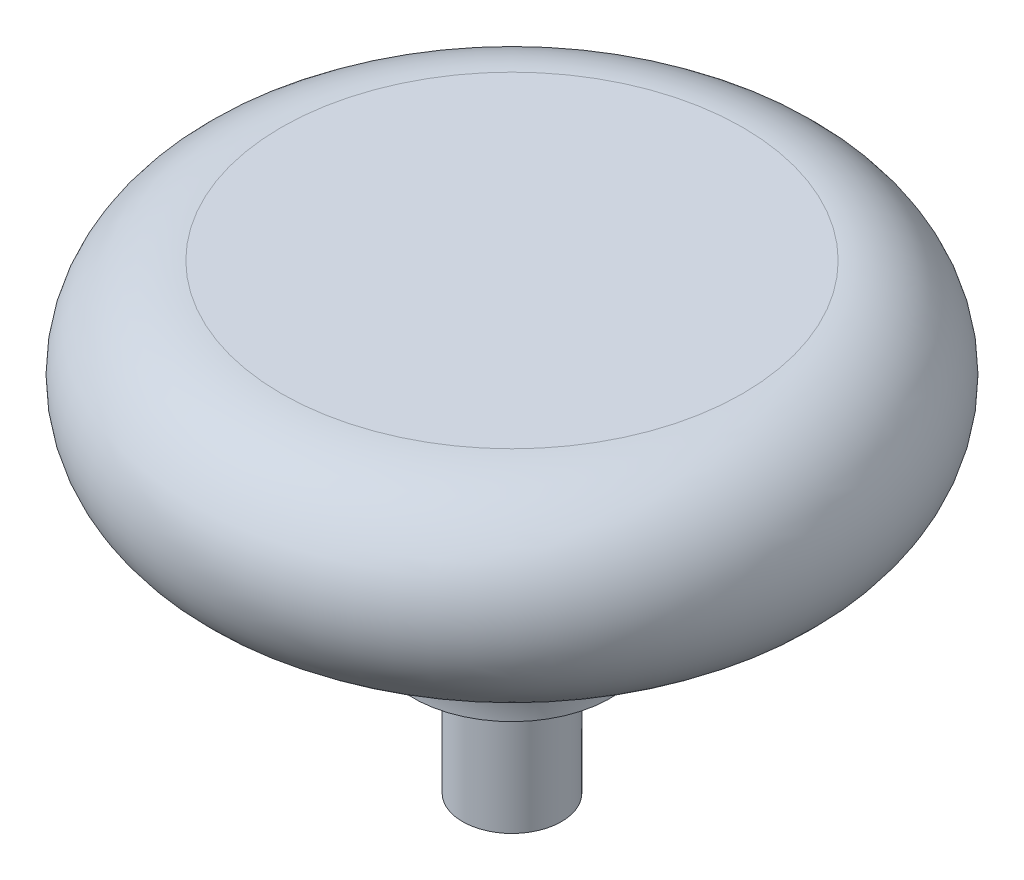
ISO-10303-21;
HEADER;
FILE_DESCRIPTION(('STEP AP214'),'2;1');
FILE_NAME('part.step','',(''),(''),'','','');
FILE_SCHEMA(('AUTOMOTIVE_DESIGN { 1 0 10303 214 1 1 1 1 }'));
ENDSEC;
DATA;
#1=APPLICATION_CONTEXT('core data for automotive mechanical design processes');
#2=APPLICATION_PROTOCOL_DEFINITION('international standard','automotive_design',2000,#1);
#3=PRODUCT_CONTEXT('',#1,'mechanical');
#4=PRODUCT('Part','Part','',(#3));
#5=PRODUCT_RELATED_PRODUCT_CATEGORY('part','',(#4));
#6=PRODUCT_DEFINITION_FORMATION('','',#4);
#7=PRODUCT_DEFINITION_CONTEXT('part definition',#1,'design');
#8=PRODUCT_DEFINITION('design','',#6,#7);
#9=PRODUCT_DEFINITION_SHAPE('','',#8);
#10=(LENGTH_UNIT() NAMED_UNIT(*) SI_UNIT(.MILLI.,.METRE.));
#11=(NAMED_UNIT(*) PLANE_ANGLE_UNIT() SI_UNIT($,.RADIAN.));
#12=(NAMED_UNIT(*) SI_UNIT($,.STERADIAN.) SOLID_ANGLE_UNIT());
#13=UNCERTAINTY_MEASURE_WITH_UNIT(LENGTH_MEASURE(1.E-05),#10,'distance_accuracy_value','');
#14=(GEOMETRIC_REPRESENTATION_CONTEXT(3) GLOBAL_UNCERTAINTY_ASSIGNED_CONTEXT((#13)) GLOBAL_UNIT_ASSIGNED_CONTEXT((#10,
#11,#12)) REPRESENTATION_CONTEXT('',''));
#15=CARTESIAN_POINT('',(0.,0.,0.));
#16=DIRECTION('',(0.,0.,1.));
#17=DIRECTION('',(1.,0.,0.));
#18=AXIS2_PLACEMENT_3D('',#15,#16,#17);
#19=CARTESIAN_POINT('',(2.38125,0.,0.));
#20=DIRECTION('',(0.,1.,0.));
#21=DIRECTION('',(0.,0.,1.));
#22=AXIS2_PLACEMENT_3D('',#19,#20,#21);
#23=PLANE('',#22);
#24=CARTESIAN_POINT('',(0.,0.,0.));
#25=DIRECTION('',(0.,-1.,0.));
#26=DIRECTION('',(0.,0.,-1.));
#27=AXIS2_PLACEMENT_3D('',#24,#25,#26);
#28=CIRCLE('',#27,2.38125);
#29=CARTESIAN_POINT('',(0.,0.,-2.38125));
#30=VERTEX_POINT('',#29);
#31=EDGE_CURVE('E49',#30,#30,#28,.T.);
#32=ORIENTED_EDGE('',*,*,#31,.T.);
#33=EDGE_LOOP('',(#32));
#34=FACE_BOUND('',#33,.T.);
#35=ADVANCED_FACE('F30',(#34),#23,.F.);
#36=CARTESIAN_POINT('',(0.,22.225,0.));
#37=DIRECTION('',(0.,-1.,0.));
#38=DIRECTION('',(0.,0.,-1.));
#39=AXIS2_PLACEMENT_3D('',#36,#37,#38);
#40=PLANE('',#39);
#41=CARTESIAN_POINT('',(0.,22.225,0.));
#42=DIRECTION('',(0.,-1.,0.));
#43=DIRECTION('',(0.,0.,-1.));
#44=AXIS2_PLACEMENT_3D('',#41,#42,#43);
#45=CIRCLE('',#44,11.1125);
#46=CARTESIAN_POINT('',(0.,22.225,-11.1125));
#47=VERTEX_POINT('',#46);
#48=EDGE_CURVE('E10',#47,#47,#45,.T.);
#49=ORIENTED_EDGE('',*,*,#48,.F.);
#50=EDGE_LOOP('',(#49));
#51=FACE_BOUND('',#50,.T.);
#52=ADVANCED_FACE('F73',(#51),#40,.F.);
#53=CARTESIAN_POINT('',(0.,17.4625,0.));
#54=DIRECTION('',(0.,-1.,0.));
#55=DIRECTION('',(0.,0.,-1.));
#56=AXIS2_PLACEMENT_3D('',#53,#54,#55);
#57=TOROIDAL_SURFACE('',#56,11.1125,4.7625);
#58=CARTESIAN_POINT('',(0.,12.7,0.));
#59=DIRECTION('',(0.,-1.,0.));
#60=DIRECTION('',(0.,0.,-1.));
#61=AXIS2_PLACEMENT_3D('',#58,#59,#60);
#62=CIRCLE('',#61,11.1125);
#63=CARTESIAN_POINT('',(0.,12.7,-11.1125));
#64=VERTEX_POINT('',#63);
#65=EDGE_CURVE('E36',#64,#64,#62,.T.);
#66=ORIENTED_EDGE('',*,*,#65,.F.);
#67=EDGE_LOOP('',(#66));
#68=FACE_BOUND('',#67,.T.);
#69=ORIENTED_EDGE('',*,*,#48,.T.);
#70=EDGE_LOOP('',(#69));
#71=FACE_BOUND('',#70,.T.);
#72=ADVANCED_FACE('F68',(#68,#71),#57,.T.);
#73=CARTESIAN_POINT('',(0.,6.35,0.));
#74=DIRECTION('',(0.,-1.,0.));
#75=DIRECTION('',(0.,0.,-1.));
#76=AXIS2_PLACEMENT_3D('',#73,#74,#75);
#77=TOROIDAL_SURFACE('',#76,11.1125,6.35);
#78=CARTESIAN_POINT('',(0.,6.35,0.));
#79=DIRECTION('',(0.,-1.,0.));
#80=DIRECTION('',(0.,0.,-1.));
#81=AXIS2_PLACEMENT_3D('',#78,#79,#80);
#82=CIRCLE('',#81,4.7625);
#83=CARTESIAN_POINT('',(0.,6.35,-4.7625));
#84=VERTEX_POINT('',#83);
#85=EDGE_CURVE('E40',#84,#84,#82,.T.);
#86=ORIENTED_EDGE('',*,*,#85,.F.);
#87=EDGE_LOOP('',(#86));
#88=FACE_BOUND('',#87,.T.);
#89=ORIENTED_EDGE('',*,*,#65,.T.);
#90=EDGE_LOOP('',(#89));
#91=FACE_BOUND('',#90,.T.);
#92=ADVANCED_FACE('F63',(#88,#91),#77,.F.);
#93=CARTESIAN_POINT('',(4.7625,6.35,0.));
#94=DIRECTION('',(0.,1.,0.));
#95=DIRECTION('',(0.,0.,1.));
#96=AXIS2_PLACEMENT_3D('',#93,#94,#95);
#97=PLANE('',#96);
#98=CARTESIAN_POINT('',(0.,6.35,0.));
#99=DIRECTION('',(0.,-1.,0.));
#100=DIRECTION('',(0.,0.,-1.));
#101=AXIS2_PLACEMENT_3D('',#98,#99,#100);
#102=CIRCLE('',#101,2.38125);
#103=CARTESIAN_POINT('',(0.,6.35,-2.38125));
#104=VERTEX_POINT('',#103);
#105=EDGE_CURVE('E44',#104,#104,#102,.T.);
#106=ORIENTED_EDGE('',*,*,#105,.F.);
#107=EDGE_LOOP('',(#106));
#108=FACE_BOUND('',#107,.T.);
#109=ORIENTED_EDGE('',*,*,#85,.T.);
#110=EDGE_LOOP('',(#109));
#111=FACE_BOUND('',#110,.T.);
#112=ADVANCED_FACE('F57',(#108,#111),#97,.F.);
#113=CARTESIAN_POINT('',(0.,0.,0.));
#114=DIRECTION('',(0.,-1.,0.));
#115=DIRECTION('',(0.,0.,-1.));
#116=AXIS2_PLACEMENT_3D('',#113,#114,#115);
#117=CYLINDRICAL_SURFACE('',#116,2.38125);
#118=ORIENTED_EDGE('',*,*,#31,.F.);
#119=EDGE_LOOP('',(#118));
#120=FACE_BOUND('',#119,.T.);
#121=ORIENTED_EDGE('',*,*,#105,.T.);
#122=EDGE_LOOP('',(#121));
#123=FACE_BOUND('',#122,.T.);
#124=ADVANCED_FACE('F54',(#120,#123),#117,.T.);
#125=CLOSED_SHELL('',(#35,#52,#72,#92,#112,#124));
#126=MANIFOLD_SOLID_BREP('B2',#125);
#127=ADVANCED_BREP_SHAPE_REPRESENTATION('',(#18,#126),#14);
#128=SHAPE_DEFINITION_REPRESENTATION(#9,#127);
ENDSEC;
END-ISO-10303-21;
